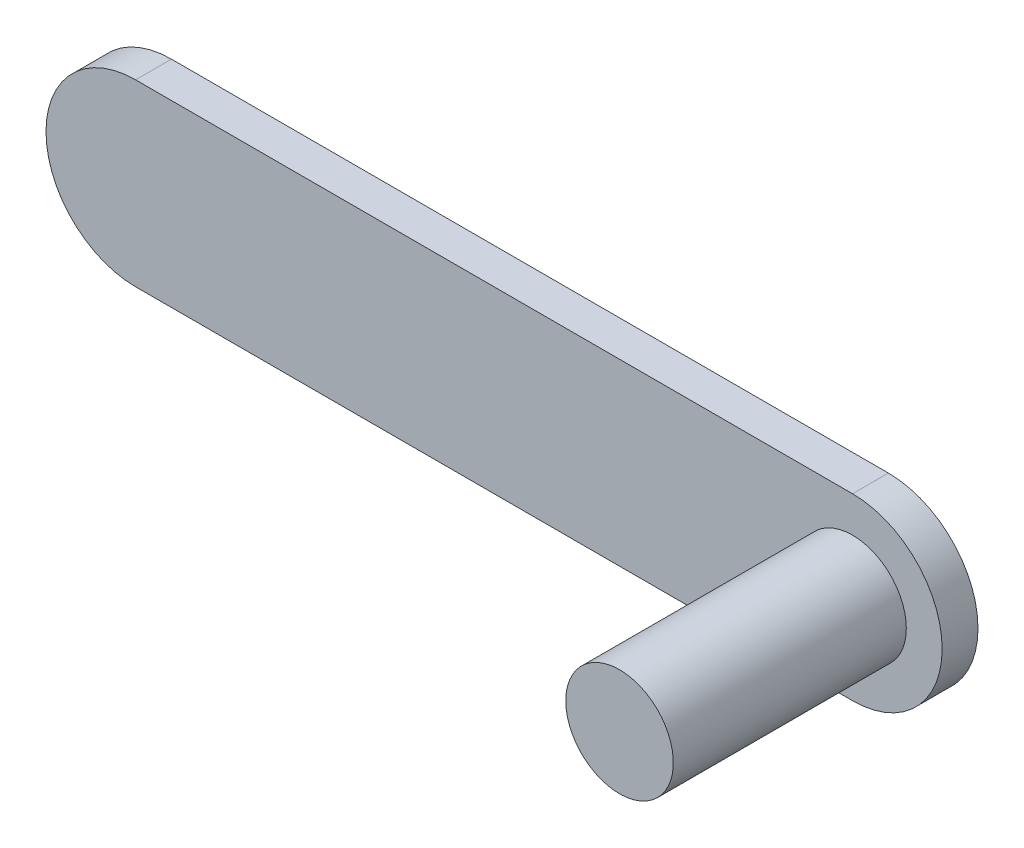
ISO-10303-21;
HEADER;
FILE_DESCRIPTION(('STEP AP214'),'2;1');
FILE_NAME('part.step','',(''),(''),'','','');
FILE_SCHEMA(('AUTOMOTIVE_DESIGN { 1 0 10303 214 1 1 1 1 }'));
ENDSEC;
DATA;
#1=APPLICATION_CONTEXT('core data for automotive mechanical design processes');
#2=APPLICATION_PROTOCOL_DEFINITION('international standard','automotive_design',2000,#1);
#3=PRODUCT_CONTEXT('',#1,'mechanical');
#4=PRODUCT('Part','Part','',(#3));
#5=PRODUCT_RELATED_PRODUCT_CATEGORY('part','',(#4));
#6=PRODUCT_DEFINITION_FORMATION('','',#4);
#7=PRODUCT_DEFINITION_CONTEXT('part definition',#1,'design');
#8=PRODUCT_DEFINITION('design','',#6,#7);
#9=PRODUCT_DEFINITION_SHAPE('','',#8);
#10=(LENGTH_UNIT() NAMED_UNIT(*) SI_UNIT(.MILLI.,.METRE.));
#11=(NAMED_UNIT(*) PLANE_ANGLE_UNIT() SI_UNIT($,.RADIAN.));
#12=(NAMED_UNIT(*) SI_UNIT($,.STERADIAN.) SOLID_ANGLE_UNIT());
#13=UNCERTAINTY_MEASURE_WITH_UNIT(LENGTH_MEASURE(1.E-05),#10,'distance_accuracy_value','');
#14=(GEOMETRIC_REPRESENTATION_CONTEXT(3) GLOBAL_UNCERTAINTY_ASSIGNED_CONTEXT((#13)) GLOBAL_UNIT_ASSIGNED_CONTEXT((#10,
#11,#12)) REPRESENTATION_CONTEXT('',''));
#15=CARTESIAN_POINT('',(0.,0.,0.));
#16=DIRECTION('',(0.,0.,1.));
#17=DIRECTION('',(1.,0.,0.));
#18=AXIS2_PLACEMENT_3D('',#15,#16,#17);
#19=CARTESIAN_POINT('',(-24.9999999999991,9.02923569245928E-13,0.));
#20=DIRECTION('',(0.,0.,1.));
#21=DIRECTION('',(1.,0.,0.));
#22=AXIS2_PLACEMENT_3D('',#19,#20,#21);
#23=PLANE('',#22);
#24=CARTESIAN_POINT('',(-24.9999999999991,9.02923569245928E-13,0.));
#25=DIRECTION('',(0.,0.,1.));
#26=DIRECTION('',(1.,0.,0.));
#27=AXIS2_PLACEMENT_3D('',#24,#25,#26);
#28=CIRCLE('',#27,5.00000000000361);
#29=CARTESIAN_POINT('',(-24.9999999999991,5.00000000000451,0.));
#30=VERTEX_POINT('',#29);
#31=CARTESIAN_POINT('',(-24.9999999999991,-5.00000000000271,0.));
#32=VERTEX_POINT('',#31);
#33=EDGE_CURVE('E98',#30,#32,#28,.T.);
#34=ORIENTED_EDGE('',*,*,#33,.F.);
#35=DIRECTION('',(-1.,0.,0.));
#36=VECTOR('',#35,1.);
#37=CARTESIAN_POINT('',(-24.9999999999991,5.00000000000451,0.));
#38=LINE('',#37,#36);
#39=CARTESIAN_POINT('',(14.9999999999964,5.00000000000451,0.));
#40=VERTEX_POINT('',#39);
#41=EDGE_CURVE('E70',#40,#30,#38,.T.);
#42=ORIENTED_EDGE('',*,*,#41,.F.);
#43=CARTESIAN_POINT('',(14.9999999999964,9.02923569245928E-13,0.));
#44=DIRECTION('',(0.,0.,1.));
#45=DIRECTION('',(1.,0.,0.));
#46=AXIS2_PLACEMENT_3D('',#43,#44,#45);
#47=CIRCLE('',#46,5.00000000000361);
#48=CARTESIAN_POINT('',(14.9999999999964,-5.00000000000271,0.));
#49=VERTEX_POINT('',#48);
#50=EDGE_CURVE('E64',#49,#40,#47,.T.);
#51=ORIENTED_EDGE('',*,*,#50,.F.);
#52=DIRECTION('',(1.,0.,0.));
#53=VECTOR('',#52,1.);
#54=CARTESIAN_POINT('',(-24.9999999999991,-5.00000000000271,0.));
#55=LINE('',#54,#53);
#56=EDGE_CURVE('E88',#32,#49,#55,.T.);
#57=ORIENTED_EDGE('',*,*,#56,.F.);
#58=EDGE_LOOP('',(#34,#42,#51,#57));
#59=FACE_BOUND('',#58,.T.);
#60=CARTESIAN_POINT('',(-25.,4.51461649097693E-12,0.));
#61=DIRECTION('',(0.,0.,1.));
#62=DIRECTION('',(1.,0.,0.));
#63=AXIS2_PLACEMENT_3D('',#60,#61,#62);
#64=CIRCLE('',#63,2.);
#65=CARTESIAN_POINT('',(-23.,4.51461649097693E-12,0.));
#66=VERTEX_POINT('',#65);
#67=EDGE_CURVE('E39',#66,#66,#64,.F.);
#68=ORIENTED_EDGE('',*,*,#67,.F.);
#69=EDGE_LOOP('',(#68));
#70=FACE_BOUND('',#69,.T.);
#71=ADVANCED_FACE('F30',(#59,#70),#23,.F.);
#72=CARTESIAN_POINT('',(-24.9999999999991,9.02923569245928E-13,2.));
#73=DIRECTION('',(0.,0.,-1.));
#74=DIRECTION('',(-1.,0.,0.));
#75=AXIS2_PLACEMENT_3D('',#72,#73,#74);
#76=CYLINDRICAL_SURFACE('',#75,5.00000000000361);
#77=ORIENTED_EDGE('',*,*,#33,.T.);
#78=DIRECTION('',(0.,0.,-1.));
#79=VECTOR('',#78,1.);
#80=CARTESIAN_POINT('',(-24.9999999999991,-5.00000000000271,2.));
#81=LINE('',#80,#79);
#82=CARTESIAN_POINT('',(-24.9999999999991,-5.00000000000271,2.));
#83=VERTEX_POINT('',#82);
#84=EDGE_CURVE('E89',#83,#32,#81,.T.);
#85=ORIENTED_EDGE('',*,*,#84,.F.);
#86=CARTESIAN_POINT('',(-24.9999999999991,9.02923569245928E-13,2.));
#87=DIRECTION('',(0.,0.,1.));
#88=DIRECTION('',(1.,0.,0.));
#89=AXIS2_PLACEMENT_3D('',#86,#87,#88);
#90=CIRCLE('',#89,5.00000000000361);
#91=CARTESIAN_POINT('',(-24.9999999999991,5.00000000000451,2.));
#92=VERTEX_POINT('',#91);
#93=EDGE_CURVE('E83',#92,#83,#90,.T.);
#94=ORIENTED_EDGE('',*,*,#93,.F.);
#95=DIRECTION('',(0.,0.,-1.));
#96=VECTOR('',#95,1.);
#97=CARTESIAN_POINT('',(-24.9999999999991,5.00000000000451,2.));
#98=LINE('',#97,#96);
#99=EDGE_CURVE('E94',#92,#30,#98,.T.);
#100=ORIENTED_EDGE('',*,*,#99,.T.);
#101=EDGE_LOOP('',(#77,#85,#94,#100));
#102=FACE_BOUND('',#101,.T.);
#103=ADVANCED_FACE('F32',(#102),#76,.T.);
#104=CARTESIAN_POINT('',(-24.9999999999991,-5.00000000000271,2.));
#105=DIRECTION('',(0.,1.,0.));
#106=DIRECTION('',(0.,0.,1.));
#107=AXIS2_PLACEMENT_3D('',#104,#105,#106);
#108=PLANE('',#107);
#109=ORIENTED_EDGE('',*,*,#56,.T.);
#110=DIRECTION('',(0.,0.,-1.));
#111=VECTOR('',#110,1.);
#112=CARTESIAN_POINT('',(14.9999999999964,-5.00000000000271,2.));
#113=LINE('',#112,#111);
#114=CARTESIAN_POINT('',(14.9999999999964,-5.00000000000271,2.));
#115=VERTEX_POINT('',#114);
#116=EDGE_CURVE('E86',#115,#49,#113,.T.);
#117=ORIENTED_EDGE('',*,*,#116,.F.);
#118=DIRECTION('',(1.,0.,0.));
#119=VECTOR('',#118,1.);
#120=CARTESIAN_POINT('',(-24.9999999999991,-5.00000000000271,2.));
#121=LINE('',#120,#119);
#122=EDGE_CURVE('E78',#83,#115,#121,.T.);
#123=ORIENTED_EDGE('',*,*,#122,.F.);
#124=ORIENTED_EDGE('',*,*,#84,.T.);
#125=EDGE_LOOP('',(#109,#117,#123,#124));
#126=FACE_BOUND('',#125,.T.);
#127=ADVANCED_FACE('F87',(#126),#108,.F.);
#128=CARTESIAN_POINT('',(14.9999999999964,9.02923569245928E-13,2.));
#129=DIRECTION('',(0.,0.,-1.));
#130=DIRECTION('',(-1.,0.,0.));
#131=AXIS2_PLACEMENT_3D('',#128,#129,#130);
#132=CYLINDRICAL_SURFACE('',#131,5.00000000000361);
#133=ORIENTED_EDGE('',*,*,#50,.T.);
#134=DIRECTION('',(0.,0.,-1.));
#135=VECTOR('',#134,1.);
#136=CARTESIAN_POINT('',(14.9999999999964,5.00000000000451,2.));
#137=LINE('',#136,#135);
#138=CARTESIAN_POINT('',(14.9999999999964,5.00000000000451,2.));
#139=VERTEX_POINT('',#138);
#140=EDGE_CURVE('E90',#139,#40,#137,.T.);
#141=ORIENTED_EDGE('',*,*,#140,.F.);
#142=CARTESIAN_POINT('',(14.9999999999964,9.02923569245928E-13,2.));
#143=DIRECTION('',(0.,0.,1.));
#144=DIRECTION('',(1.,0.,0.));
#145=AXIS2_PLACEMENT_3D('',#142,#143,#144);
#146=CIRCLE('',#145,5.00000000000361);
#147=EDGE_CURVE('E81',#115,#139,#146,.T.);
#148=ORIENTED_EDGE('',*,*,#147,.F.);
#149=ORIENTED_EDGE('',*,*,#116,.T.);
#150=EDGE_LOOP('',(#133,#141,#148,#149));
#151=FACE_BOUND('',#150,.T.);
#152=ADVANCED_FACE('F92',(#151),#132,.T.);
#153=CARTESIAN_POINT('',(-24.9999999999991,5.00000000000451,2.));
#154=DIRECTION('',(0.,-1.,0.));
#155=DIRECTION('',(0.,0.,-1.));
#156=AXIS2_PLACEMENT_3D('',#153,#154,#155);
#157=PLANE('',#156);
#158=ORIENTED_EDGE('',*,*,#41,.T.);
#159=ORIENTED_EDGE('',*,*,#99,.F.);
#160=DIRECTION('',(-1.,0.,0.));
#161=VECTOR('',#160,1.);
#162=CARTESIAN_POINT('',(-24.9999999999991,5.00000000000451,2.));
#163=LINE('',#162,#161);
#164=EDGE_CURVE('E47',#139,#92,#163,.T.);
#165=ORIENTED_EDGE('',*,*,#164,.F.);
#166=ORIENTED_EDGE('',*,*,#140,.T.);
#167=EDGE_LOOP('',(#158,#159,#165,#166));
#168=FACE_BOUND('',#167,.T.);
#169=ADVANCED_FACE('F123',(#168),#157,.F.);
#170=CARTESIAN_POINT('',(-24.9999999999991,9.02923569245928E-13,2.));
#171=DIRECTION('',(0.,0.,1.));
#172=DIRECTION('',(1.,0.,0.));
#173=AXIS2_PLACEMENT_3D('',#170,#171,#172);
#174=PLANE('',#173);
#175=CARTESIAN_POINT('',(15.,-2.70876989458615E-12,2.));
#176=DIRECTION('',(0.,0.,1.));
#177=DIRECTION('',(1.,0.,0.));
#178=AXIS2_PLACEMENT_3D('',#175,#176,#177);
#179=CIRCLE('',#178,3.);
#180=CARTESIAN_POINT('',(18.,-2.70876989458615E-12,2.));
#181=VERTEX_POINT('',#180);
#182=EDGE_CURVE('E11',#181,#181,#179,.T.);
#183=ORIENTED_EDGE('',*,*,#182,.F.);
#184=EDGE_LOOP('',(#183));
#185=FACE_BOUND('',#184,.T.);
#186=ORIENTED_EDGE('',*,*,#93,.T.);
#187=ORIENTED_EDGE('',*,*,#122,.T.);
#188=ORIENTED_EDGE('',*,*,#147,.T.);
#189=ORIENTED_EDGE('',*,*,#164,.T.);
#190=EDGE_LOOP('',(#186,#187,#188,#189));
#191=FACE_BOUND('',#190,.T.);
#192=ADVANCED_FACE('F79',(#185,#191),#174,.T.);
#193=CARTESIAN_POINT('',(-25.,4.51461649097693E-12,-2.));
#194=DIRECTION('',(0.,0.,1.));
#195=DIRECTION('',(1.,0.,0.));
#196=AXIS2_PLACEMENT_3D('',#193,#194,#195);
#197=CYLINDRICAL_SURFACE('',#196,2.);
#198=CARTESIAN_POINT('',(-25.,4.51461649097693E-12,-2.));
#199=DIRECTION('',(0.,0.,-1.));
#200=DIRECTION('',(-1.,0.,0.));
#201=AXIS2_PLACEMENT_3D('',#198,#199,#200);
#202=CIRCLE('',#201,2.);
#203=CARTESIAN_POINT('',(-27.,4.51461649097693E-12,-2.));
#204=VERTEX_POINT('',#203);
#205=EDGE_CURVE('E101',#204,#204,#202,.T.);
#206=ORIENTED_EDGE('',*,*,#205,.F.);
#207=EDGE_LOOP('',(#206));
#208=FACE_BOUND('',#207,.T.);
#209=ORIENTED_EDGE('',*,*,#67,.T.);
#210=EDGE_LOOP('',(#209));
#211=FACE_BOUND('',#210,.T.);
#212=ADVANCED_FACE('F110',(#208,#211),#197,.T.);
#213=CARTESIAN_POINT('',(-25.,4.51461649097693E-12,-2.));
#214=DIRECTION('',(0.,0.,-1.));
#215=DIRECTION('',(-1.,0.,0.));
#216=AXIS2_PLACEMENT_3D('',#213,#214,#215);
#217=PLANE('',#216);
#218=ORIENTED_EDGE('',*,*,#205,.T.);
#219=EDGE_LOOP('',(#218));
#220=FACE_BOUND('',#219,.T.);
#221=ADVANCED_FACE('F153',(#220),#217,.T.);
#222=CARTESIAN_POINT('',(15.,-2.70876989458615E-12,15.));
#223=DIRECTION('',(0.,0.,-1.));
#224=DIRECTION('',(-1.,0.,0.));
#225=AXIS2_PLACEMENT_3D('',#222,#223,#224);
#226=CYLINDRICAL_SURFACE('',#225,3.);
#227=ORIENTED_EDGE('',*,*,#182,.T.);
#228=EDGE_LOOP('',(#227));
#229=FACE_BOUND('',#228,.T.);
#230=CARTESIAN_POINT('',(15.,-2.70876989458615E-12,15.));
#231=DIRECTION('',(0.,0.,-1.));
#232=DIRECTION('',(-1.,0.,0.));
#233=AXIS2_PLACEMENT_3D('',#230,#231,#232);
#234=CIRCLE('',#233,3.);
#235=CARTESIAN_POINT('',(12.,-2.70876989458615E-12,15.));
#236=VERTEX_POINT('',#235);
#237=EDGE_CURVE('E204',#236,#236,#234,.T.);
#238=ORIENTED_EDGE('',*,*,#237,.T.);
#239=EDGE_LOOP('',(#238));
#240=FACE_BOUND('',#239,.T.);
#241=ADVANCED_FACE('F160',(#229,#240),#226,.T.);
#242=CARTESIAN_POINT('',(15.,-2.70876989458615E-12,15.));
#243=DIRECTION('',(0.,0.,-1.));
#244=DIRECTION('',(-1.,0.,0.));
#245=AXIS2_PLACEMENT_3D('',#242,#243,#244);
#246=PLANE('',#245);
#247=ORIENTED_EDGE('',*,*,#237,.F.);
#248=EDGE_LOOP('',(#247));
#249=FACE_BOUND('',#248,.T.);
#250=ADVANCED_FACE('F167',(#249),#246,.F.);
#251=CLOSED_SHELL('',(#71,#103,#127,#152,#169,#192,#212,#221,#241,#250));
#252=MANIFOLD_SOLID_BREP('B2',#251);
#253=ADVANCED_BREP_SHAPE_REPRESENTATION('',(#18,#252),#14);
#254=SHAPE_DEFINITION_REPRESENTATION(#9,#253);
ENDSEC;
END-ISO-10303-21;
